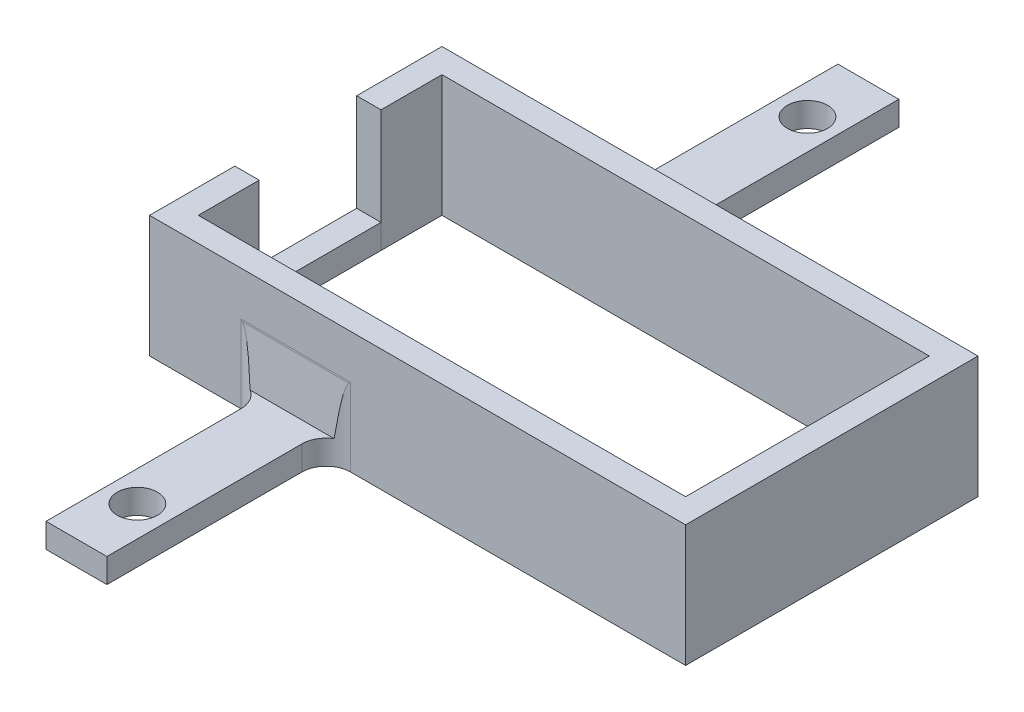
ISO-10303-21;
HEADER;
FILE_DESCRIPTION(('STEP AP214'),'2;1');
FILE_NAME('part.step','',(''),(''),'','','');
FILE_SCHEMA(('AUTOMOTIVE_DESIGN { 1 0 10303 214 1 1 1 1 }'));
ENDSEC;
DATA;
#1=APPLICATION_CONTEXT('core data for automotive mechanical design processes');
#2=APPLICATION_PROTOCOL_DEFINITION('international standard','automotive_design',2000,#1);
#3=PRODUCT_CONTEXT('',#1,'mechanical');
#4=PRODUCT('Part','Part','',(#3));
#5=PRODUCT_RELATED_PRODUCT_CATEGORY('part','',(#4));
#6=PRODUCT_DEFINITION_FORMATION('','',#4);
#7=PRODUCT_DEFINITION_CONTEXT('part definition',#1,'design');
#8=PRODUCT_DEFINITION('design','',#6,#7);
#9=PRODUCT_DEFINITION_SHAPE('','',#8);
#10=(LENGTH_UNIT() NAMED_UNIT(*) SI_UNIT(.MILLI.,.METRE.));
#11=(NAMED_UNIT(*) PLANE_ANGLE_UNIT() SI_UNIT($,.RADIAN.));
#12=(NAMED_UNIT(*) SI_UNIT($,.STERADIAN.) SOLID_ANGLE_UNIT());
#13=UNCERTAINTY_MEASURE_WITH_UNIT(LENGTH_MEASURE(1.E-05),#10,'distance_accuracy_value','');
#14=(GEOMETRIC_REPRESENTATION_CONTEXT(3) GLOBAL_UNCERTAINTY_ASSIGNED_CONTEXT((#13)) GLOBAL_UNIT_ASSIGNED_CONTEXT((#10,
#11,#12)) REPRESENTATION_CONTEXT('',''));
#15=CARTESIAN_POINT('',(0.,0.,0.));
#16=DIRECTION('',(0.,0.,1.));
#17=DIRECTION('',(1.,0.,0.));
#18=AXIS2_PLACEMENT_3D('',#15,#16,#17);
#19=CARTESIAN_POINT('',(-9.49999999999999,2.,-25.));
#20=DIRECTION('',(-1.,0.,0.));
#21=DIRECTION('',(0.,0.,1.));
#22=AXIS2_PLACEMENT_3D('',#19,#20,#21);
#23=PLANE('',#22);
#24=DIRECTION('',(0.,0.,-1.));
#25=VECTOR('',#24,1.);
#26=CARTESIAN_POINT('',(-9.49999999999999,0.,-25.));
#27=LINE('',#26,#25);
#28=CARTESIAN_POINT('',(-9.49999999999999,0.,-25.));
#29=VERTEX_POINT('',#28);
#30=CARTESIAN_POINT('',(-9.49999999999999,0.,-35.));
#31=VERTEX_POINT('',#30);
#32=EDGE_CURVE('E111',#29,#31,#27,.T.);
#33=ORIENTED_EDGE('',*,*,#32,.F.);
#34=DIRECTION('',(0.,-1.,0.));
#35=VECTOR('',#34,1.);
#36=CARTESIAN_POINT('',(-9.49999999999999,2.,-25.));
#37=LINE('',#36,#35);
#38=CARTESIAN_POINT('',(-9.49999999999999,2.,-25.));
#39=VERTEX_POINT('',#38);
#40=EDGE_CURVE('E12',#39,#29,#37,.T.);
#41=ORIENTED_EDGE('',*,*,#40,.F.);
#42=DIRECTION('',(0.,0.,-1.));
#43=VECTOR('',#42,1.);
#44=CARTESIAN_POINT('',(-9.49999999999999,2.,-25.));
#45=LINE('',#44,#43);
#46=CARTESIAN_POINT('',(-9.49999999999999,2.,-35.));
#47=VERTEX_POINT('',#46);
#48=EDGE_CURVE('E105',#39,#47,#45,.T.);
#49=ORIENTED_EDGE('',*,*,#48,.T.);
#50=DIRECTION('',(0.,-1.,0.));
#51=VECTOR('',#50,1.);
#52=CARTESIAN_POINT('',(-9.49999999999999,2.,-35.));
#53=LINE('',#52,#51);
#54=EDGE_CURVE('E50',#47,#31,#53,.T.);
#55=ORIENTED_EDGE('',*,*,#54,.T.);
#56=EDGE_LOOP('',(#33,#41,#49,#55));
#57=FACE_BOUND('',#56,.T.);
#58=ADVANCED_FACE('F47',(#57),#23,.T.);
#59=CARTESIAN_POINT('',(-9.49999999999999,2.,-25.));
#60=DIRECTION('',(0.,0.,1.));
#61=DIRECTION('',(1.,0.,0.));
#62=AXIS2_PLACEMENT_3D('',#59,#60,#61);
#63=PLANE('',#62);
#64=DIRECTION('',(-1.,0.,0.));
#65=VECTOR('',#64,1.);
#66=CARTESIAN_POINT('',(-9.49999999999999,0.,-25.));
#67=LINE('',#66,#65);
#68=CARTESIAN_POINT('',(-7.49999999999999,0.,-25.));
#69=VERTEX_POINT('',#68);
#70=EDGE_CURVE('E107',#69,#29,#67,.T.);
#71=ORIENTED_EDGE('',*,*,#70,.F.);
#72=DIRECTION('',(0.,-1.,0.));
#73=VECTOR('',#72,1.);
#74=CARTESIAN_POINT('',(-7.49999999999999,2.,-25.));
#75=LINE('',#74,#73);
#76=CARTESIAN_POINT('',(-7.49999999999999,2.,-25.));
#77=VERTEX_POINT('',#76);
#78=EDGE_CURVE('E56',#77,#69,#75,.T.);
#79=ORIENTED_EDGE('',*,*,#78,.F.);
#80=DIRECTION('',(-1.,0.,0.));
#81=VECTOR('',#80,1.);
#82=CARTESIAN_POINT('',(-9.49999999999999,2.,-25.));
#83=LINE('',#82,#81);
#84=EDGE_CURVE('E102',#77,#39,#83,.T.);
#85=ORIENTED_EDGE('',*,*,#84,.T.);
#86=ORIENTED_EDGE('',*,*,#40,.T.);
#87=EDGE_LOOP('',(#71,#79,#85,#86));
#88=FACE_BOUND('',#87,.T.);
#89=ADVANCED_FACE('F121',(#88),#63,.T.);
#90=CARTESIAN_POINT('',(-7.49999999999999,2.,-25.));
#91=DIRECTION('',(1.,0.,0.));
#92=DIRECTION('',(0.,0.,-1.));
#93=AXIS2_PLACEMENT_3D('',#90,#91,#92);
#94=PLANE('',#93);
#95=DIRECTION('',(0.,0.,1.));
#96=VECTOR('',#95,1.);
#97=CARTESIAN_POINT('',(-7.49999999999999,0.,-25.));
#98=LINE('',#97,#96);
#99=CARTESIAN_POINT('',(-7.49999999999999,0.,-35.));
#100=VERTEX_POINT('',#99);
#101=EDGE_CURVE('E97',#100,#69,#98,.T.);
#102=ORIENTED_EDGE('',*,*,#101,.F.);
#103=DIRECTION('',(0.,-1.,0.));
#104=VECTOR('',#103,1.);
#105=CARTESIAN_POINT('',(-7.49999999999999,2.,-35.));
#106=LINE('',#105,#104);
#107=CARTESIAN_POINT('',(-7.49999999999999,2.,-35.));
#108=VERTEX_POINT('',#107);
#109=EDGE_CURVE('E92',#108,#100,#106,.T.);
#110=ORIENTED_EDGE('',*,*,#109,.F.);
#111=DIRECTION('',(0.,0.,1.));
#112=VECTOR('',#111,1.);
#113=CARTESIAN_POINT('',(-7.49999999999999,2.,-25.));
#114=LINE('',#113,#112);
#115=EDGE_CURVE('E95',#108,#77,#114,.T.);
#116=ORIENTED_EDGE('',*,*,#115,.T.);
#117=ORIENTED_EDGE('',*,*,#78,.T.);
#118=EDGE_LOOP('',(#102,#110,#116,#117));
#119=FACE_BOUND('',#118,.T.);
#120=ADVANCED_FACE('F94',(#119),#94,.T.);
#121=CARTESIAN_POINT('',(-9.49999999999999,2.,-35.));
#122=DIRECTION('',(0.,0.,-1.));
#123=DIRECTION('',(-1.,0.,0.));
#124=AXIS2_PLACEMENT_3D('',#121,#122,#123);
#125=PLANE('',#124);
#126=DIRECTION('',(1.,0.,0.));
#127=VECTOR('',#126,1.);
#128=CARTESIAN_POINT('',(-9.49999999999999,0.,-35.));
#129=LINE('',#128,#127);
#130=EDGE_CURVE('E114',#31,#100,#129,.T.);
#131=ORIENTED_EDGE('',*,*,#130,.F.);
#132=ORIENTED_EDGE('',*,*,#54,.F.);
#133=DIRECTION('',(1.,0.,0.));
#134=VECTOR('',#133,1.);
#135=CARTESIAN_POINT('',(-9.49999999999999,2.,-35.));
#136=LINE('',#135,#134);
#137=EDGE_CURVE('E101',#47,#108,#136,.T.);
#138=ORIENTED_EDGE('',*,*,#137,.T.);
#139=ORIENTED_EDGE('',*,*,#109,.T.);
#140=EDGE_LOOP('',(#131,#132,#138,#139));
#141=FACE_BOUND('',#140,.T.);
#142=ADVANCED_FACE('F104',(#141),#125,.T.);
#143=CARTESIAN_POINT('',(0.,2.,0.));
#144=DIRECTION('',(0.,-1.,0.));
#145=DIRECTION('',(0.,0.,-1.));
#146=AXIS2_PLACEMENT_3D('',#143,#144,#145);
#147=PLANE('',#146);
#148=ORIENTED_EDGE('',*,*,#48,.F.);
#149=ORIENTED_EDGE('',*,*,#84,.F.);
#150=ORIENTED_EDGE('',*,*,#115,.F.);
#151=ORIENTED_EDGE('',*,*,#137,.F.);
#152=EDGE_LOOP('',(#148,#149,#150,#151));
#153=FACE_BOUND('',#152,.T.);
#154=ADVANCED_FACE('F100',(#153),#147,.F.);
#155=CARTESIAN_POINT('',(0.,0.,0.));
#156=DIRECTION('',(0.,-1.,0.));
#157=DIRECTION('',(0.,0.,-1.));
#158=AXIS2_PLACEMENT_3D('',#155,#156,#157);
#159=PLANE('',#158);
#160=ORIENTED_EDGE('',*,*,#32,.T.);
#161=ORIENTED_EDGE('',*,*,#130,.T.);
#162=ORIENTED_EDGE('',*,*,#101,.T.);
#163=ORIENTED_EDGE('',*,*,#70,.T.);
#164=EDGE_LOOP('',(#160,#161,#162,#163));
#165=FACE_BOUND('',#164,.T.);
#166=ADVANCED_FACE('F120',(#165),#159,.T.);
#167=CLOSED_SHELL('',(#58,#89,#120,#142,#154,#166));
#168=MANIFOLD_SOLID_BREP('B2',#167);
#169=CARTESIAN_POINT('',(0.,10.,-18.));
#170=DIRECTION('',(0.,0.,-1.));
#171=DIRECTION('',(-1.,0.,0.));
#172=AXIS2_PLACEMENT_3D('',#169,#170,#171);
#173=PLANE('',#172);
#174=DIRECTION('',(1.,0.,0.));
#175=VECTOR('',#174,1.);
#176=CARTESIAN_POINT('',(0.,0.,-18.));
#177=LINE('',#176,#175);
#178=CARTESIAN_POINT('',(-9.49999999999999,0.,-18.));
#179=VERTEX_POINT('',#178);
#180=CARTESIAN_POINT('',(-2.,0.,-18.));
#181=VERTEX_POINT('',#180);
#182=EDGE_CURVE('E491',#179,#181,#177,.T.);
#183=ORIENTED_EDGE('',*,*,#182,.T.);
#184=DIRECTION('',(0.,-1.,0.));
#185=VECTOR('',#184,1.);
#186=CARTESIAN_POINT('',(-2.,10.,-18.));
#187=LINE('',#186,#185);
#188=CARTESIAN_POINT('',(-2.,6.38444522981359,-18.));
#189=VERTEX_POINT('',#188);
#190=EDGE_CURVE('E428',#181,#189,#187,.F.);
#191=ORIENTED_EDGE('',*,*,#190,.T.);
#192=DIRECTION('',(1.,0.,0.));
#193=VECTOR('',#192,1.);
#194=CARTESIAN_POINT('',(0.,6.38444522981358,-18.));
#195=LINE('',#194,#193);
#196=CARTESIAN_POINT('',(7.00000000000001,6.38444522981356,-18.));
#197=VERTEX_POINT('',#196);
#198=EDGE_CURVE('E425',#189,#197,#195,.T.);
#199=ORIENTED_EDGE('',*,*,#198,.T.);
#200=DIRECTION('',(0.,-1.,0.));
#201=VECTOR('',#200,1.);
#202=CARTESIAN_POINT('',(7.00000000000001,0.,-18.));
#203=LINE('',#202,#201);
#204=CARTESIAN_POINT('',(7.00000000000001,0.,-18.));
#205=VERTEX_POINT('',#204);
#206=EDGE_CURVE('E423',#197,#205,#203,.T.);
#207=ORIENTED_EDGE('',*,*,#206,.T.);
#208=DIRECTION('',(1.,0.,0.));
#209=VECTOR('',#208,1.);
#210=CARTESIAN_POINT('',(0.,0.,-18.));
#211=LINE('',#210,#209);
#212=CARTESIAN_POINT('',(34.5,0.,-18.));
#213=VERTEX_POINT('',#212);
#214=EDGE_CURVE('E508',#205,#213,#211,.T.);
#215=ORIENTED_EDGE('',*,*,#214,.T.);
#216=DIRECTION('',(0.,-1.,0.));
#217=VECTOR('',#216,1.);
#218=CARTESIAN_POINT('',(34.5,10.,-18.));
#219=LINE('',#218,#217);
#220=CARTESIAN_POINT('',(34.5,10.,-18.));
#221=VERTEX_POINT('',#220);
#222=EDGE_CURVE('E385',#221,#213,#219,.T.);
#223=ORIENTED_EDGE('',*,*,#222,.F.);
#224=DIRECTION('',(1.,0.,0.));
#225=VECTOR('',#224,1.);
#226=CARTESIAN_POINT('',(0.,10.,-18.));
#227=LINE('',#226,#225);
#228=CARTESIAN_POINT('',(-9.49999999999999,10.,-18.));
#229=VERTEX_POINT('',#228);
#230=EDGE_CURVE('E555',#229,#221,#227,.T.);
#231=ORIENTED_EDGE('',*,*,#230,.F.);
#232=DIRECTION('',(0.,-1.,0.));
#233=VECTOR('',#232,1.);
#234=CARTESIAN_POINT('',(-9.49999999999999,10.,-18.));
#235=LINE('',#234,#233);
#236=EDGE_CURVE('E380',#229,#179,#235,.T.);
#237=ORIENTED_EDGE('',*,*,#236,.T.);
#238=EDGE_LOOP('',(#183,#191,#199,#207,#215,#223,#231,#237));
#239=FACE_BOUND('',#238,.T.);
#240=ADVANCED_FACE('F171',(#239),#173,.F.);
#241=CARTESIAN_POINT('',(0.,10.,0.));
#242=DIRECTION('',(-1.,0.,0.));
#243=DIRECTION('',(0.,0.,1.));
#244=AXIS2_PLACEMENT_3D('',#241,#242,#243);
#245=PLANE('',#244);
#246=DIRECTION('',(0.,0.,-1.));
#247=VECTOR('',#246,1.);
#248=CARTESIAN_POINT('',(0.,0.,0.));
#249=LINE('',#248,#247);
#250=CARTESIAN_POINT('',(0.,0.,-44.));
#251=VERTEX_POINT('',#250);
#252=CARTESIAN_POINT('',(0.,0.,-65.));
#253=VERTEX_POINT('',#252);
#254=EDGE_CURVE('E563',#251,#253,#249,.T.);
#255=ORIENTED_EDGE('',*,*,#254,.F.);
#256=DIRECTION('',(0.,-1.,0.));
#257=VECTOR('',#256,1.);
#258=CARTESIAN_POINT('',(0.,6.31531671911633,-44.));
#259=LINE('',#258,#257);
#260=CARTESIAN_POINT('',(0.,2.,-44.));
#261=VERTEX_POINT('',#260);
#262=EDGE_CURVE('E432',#251,#261,#259,.F.);
#263=ORIENTED_EDGE('',*,*,#262,.T.);
#264=DIRECTION('',(0.,0.,1.));
#265=VECTOR('',#264,1.);
#266=CARTESIAN_POINT('',(0.,2.,-65.));
#267=LINE('',#266,#265);
#268=CARTESIAN_POINT('',(0.,2.,-65.));
#269=VERTEX_POINT('',#268);
#270=EDGE_CURVE('E647',#269,#261,#267,.T.);
#271=ORIENTED_EDGE('',*,*,#270,.F.);
#272=DIRECTION('',(0.,-1.,0.));
#273=VECTOR('',#272,1.);
#274=CARTESIAN_POINT('',(0.,10.,-65.));
#275=LINE('',#274,#273);
#276=EDGE_CURVE('E524',#269,#253,#275,.T.);
#277=ORIENTED_EDGE('',*,*,#276,.T.);
#278=EDGE_LOOP('',(#255,#263,#271,#277));
#279=FACE_BOUND('',#278,.T.);
#280=ADVANCED_FACE('F646',(#279),#245,.T.);
#281=CARTESIAN_POINT('',(0.,10.,0.));
#282=DIRECTION('',(-1.,0.,0.));
#283=DIRECTION('',(0.,0.,1.));
#284=AXIS2_PLACEMENT_3D('',#281,#282,#283);
#285=PLANE('',#284);
#286=DIRECTION('',(0.,0.,1.));
#287=VECTOR('',#286,1.);
#288=CARTESIAN_POINT('',(0.,2.,-18.));
#289=LINE('',#288,#287);
#290=CARTESIAN_POINT('',(0.,2.,-16.));
#291=VERTEX_POINT('',#290);
#292=CARTESIAN_POINT('',(0.,2.,0.));
#293=VERTEX_POINT('',#292);
#294=EDGE_CURVE('E353',#291,#293,#289,.T.);
#295=ORIENTED_EDGE('',*,*,#294,.F.);
#296=DIRECTION('',(0.,-1.,0.));
#297=VECTOR('',#296,1.);
#298=CARTESIAN_POINT('',(0.,10.,-16.));
#299=LINE('',#298,#297);
#300=CARTESIAN_POINT('',(0.,0.,-16.));
#301=VERTEX_POINT('',#300);
#302=EDGE_CURVE('E436',#291,#301,#299,.T.);
#303=ORIENTED_EDGE('',*,*,#302,.T.);
#304=DIRECTION('',(0.,0.,-1.));
#305=VECTOR('',#304,1.);
#306=CARTESIAN_POINT('',(0.,0.,0.));
#307=LINE('',#306,#305);
#308=CARTESIAN_POINT('',(0.,0.,0.));
#309=VERTEX_POINT('',#308);
#310=EDGE_CURVE('E379',#309,#301,#307,.T.);
#311=ORIENTED_EDGE('',*,*,#310,.F.);
#312=DIRECTION('',(0.,-1.,0.));
#313=VECTOR('',#312,1.);
#314=CARTESIAN_POINT('',(0.,10.,0.));
#315=LINE('',#314,#313);
#316=EDGE_CURVE('E371',#293,#309,#315,.T.);
#317=ORIENTED_EDGE('',*,*,#316,.F.);
#318=EDGE_LOOP('',(#295,#303,#311,#317));
#319=FACE_BOUND('',#318,.T.);
#320=ADVANCED_FACE('F377',(#319),#285,.T.);
#321=CARTESIAN_POINT('',(0.,10.,0.));
#322=DIRECTION('',(0.,0.,-1.));
#323=DIRECTION('',(-1.,0.,0.));
#324=AXIS2_PLACEMENT_3D('',#321,#322,#323);
#325=PLANE('',#324);
#326=DIRECTION('',(1.,0.,0.));
#327=VECTOR('',#326,1.);
#328=CARTESIAN_POINT('',(0.,2.,0.));
#329=LINE('',#328,#327);
#330=CARTESIAN_POINT('',(5.00000000000002,2.,0.));
#331=VERTEX_POINT('',#330);
#332=EDGE_CURVE('E358',#293,#331,#329,.T.);
#333=ORIENTED_EDGE('',*,*,#332,.F.);
#334=ORIENTED_EDGE('',*,*,#316,.T.);
#335=DIRECTION('',(1.,0.,0.));
#336=VECTOR('',#335,1.);
#337=CARTESIAN_POINT('',(0.,0.,0.));
#338=LINE('',#337,#336);
#339=CARTESIAN_POINT('',(5.00000000000002,0.,0.));
#340=VERTEX_POINT('',#339);
#341=EDGE_CURVE('E498',#309,#340,#338,.T.);
#342=ORIENTED_EDGE('',*,*,#341,.T.);
#343=DIRECTION('',(0.,-1.,0.));
#344=VECTOR('',#343,1.);
#345=CARTESIAN_POINT('',(5.00000000000002,10.,0.));
#346=LINE('',#345,#344);
#347=EDGE_CURVE('E373',#331,#340,#346,.T.);
#348=ORIENTED_EDGE('',*,*,#347,.F.);
#349=EDGE_LOOP('',(#333,#334,#342,#348));
#350=FACE_BOUND('',#349,.T.);
#351=ADVANCED_FACE('F369',(#350),#325,.F.);
#352=CARTESIAN_POINT('',(5.00000000000002,10.,0.));
#353=DIRECTION('',(-1.,0.,0.));
#354=DIRECTION('',(0.,0.,1.));
#355=AXIS2_PLACEMENT_3D('',#352,#353,#354);
#356=PLANE('',#355);
#357=DIRECTION('',(0.,0.,-1.));
#358=VECTOR('',#357,1.);
#359=CARTESIAN_POINT('',(5.00000000000002,0.,0.));
#360=LINE('',#359,#358);
#361=CARTESIAN_POINT('',(5.00000000000001,0.,-16.));
#362=VERTEX_POINT('',#361);
#363=EDGE_CURVE('E505',#340,#362,#360,.T.);
#364=ORIENTED_EDGE('',*,*,#363,.T.);
#365=DIRECTION('',(0.,-1.,0.));
#366=VECTOR('',#365,1.);
#367=CARTESIAN_POINT('',(5.00000000000001,6.31531671911643,-16.));
#368=LINE('',#367,#366);
#369=CARTESIAN_POINT('',(5.00000000000001,2.,-16.));
#370=VERTEX_POINT('',#369);
#371=EDGE_CURVE('E438',#362,#370,#368,.F.);
#372=ORIENTED_EDGE('',*,*,#371,.T.);
#373=DIRECTION('',(0.,0.,-1.));
#374=VECTOR('',#373,1.);
#375=CARTESIAN_POINT('',(5.00000000000001,2.,-18.));
#376=LINE('',#375,#374);
#377=EDGE_CURVE('E374',#331,#370,#376,.T.);
#378=ORIENTED_EDGE('',*,*,#377,.F.);
#379=ORIENTED_EDGE('',*,*,#347,.T.);
#380=EDGE_LOOP('',(#364,#372,#378,#379));
#381=FACE_BOUND('',#380,.T.);
#382=ADVANCED_FACE('F688',(#381),#356,.F.);
#383=CARTESIAN_POINT('',(5.00000000000002,10.,0.));
#384=DIRECTION('',(-1.,0.,0.));
#385=DIRECTION('',(0.,0.,1.));
#386=AXIS2_PLACEMENT_3D('',#383,#384,#385);
#387=PLANE('',#386);
#388=DIRECTION('',(0.,0.,-1.));
#389=VECTOR('',#388,1.);
#390=CARTESIAN_POINT('',(5.,2.,-65.));
#391=LINE('',#390,#389);
#392=CARTESIAN_POINT('',(5.,2.,-44.));
#393=VERTEX_POINT('',#392);
#394=CARTESIAN_POINT('',(5.,2.,-65.));
#395=VERTEX_POINT('',#394);
#396=EDGE_CURVE('E653',#393,#395,#391,.T.);
#397=ORIENTED_EDGE('',*,*,#396,.F.);
#398=DIRECTION('',(0.,-1.,0.));
#399=VECTOR('',#398,1.);
#400=CARTESIAN_POINT('',(5.,10.,-44.));
#401=LINE('',#400,#399);
#402=CARTESIAN_POINT('',(5.,0.,-44.));
#403=VERTEX_POINT('',#402);
#404=EDGE_CURVE('E434',#393,#403,#401,.T.);
#405=ORIENTED_EDGE('',*,*,#404,.T.);
#406=DIRECTION('',(0.,0.,-1.));
#407=VECTOR('',#406,1.);
#408=CARTESIAN_POINT('',(5.00000000000002,0.,0.));
#409=LINE('',#408,#407);
#410=CARTESIAN_POINT('',(5.,0.,-65.));
#411=VERTEX_POINT('',#410);
#412=EDGE_CURVE('E515',#403,#411,#409,.T.);
#413=ORIENTED_EDGE('',*,*,#412,.T.);
#414=DIRECTION('',(0.,-1.,0.));
#415=VECTOR('',#414,1.);
#416=CARTESIAN_POINT('',(5.,10.,-65.));
#417=LINE('',#416,#415);
#418=EDGE_CURVE('E527',#395,#411,#417,.T.);
#419=ORIENTED_EDGE('',*,*,#418,.F.);
#420=EDGE_LOOP('',(#397,#405,#413,#419));
#421=FACE_BOUND('',#420,.T.);
#422=ADVANCED_FACE('F691',(#421),#387,.F.);
#423=CARTESIAN_POINT('',(0.,10.,-65.));
#424=DIRECTION('',(0.,0.,-1.));
#425=DIRECTION('',(-1.,0.,0.));
#426=AXIS2_PLACEMENT_3D('',#423,#424,#425);
#427=PLANE('',#426);
#428=ORIENTED_EDGE('',*,*,#276,.F.);
#429=DIRECTION('',(-1.,0.,0.));
#430=VECTOR('',#429,1.);
#431=CARTESIAN_POINT('',(0.,2.,-65.));
#432=LINE('',#431,#430);
#433=EDGE_CURVE('E365',#395,#269,#432,.T.);
#434=ORIENTED_EDGE('',*,*,#433,.F.);
#435=ORIENTED_EDGE('',*,*,#418,.T.);
#436=DIRECTION('',(1.,0.,0.));
#437=VECTOR('',#436,1.);
#438=CARTESIAN_POINT('',(0.,0.,-65.));
#439=LINE('',#438,#437);
#440=EDGE_CURVE('E517',#253,#411,#439,.T.);
#441=ORIENTED_EDGE('',*,*,#440,.F.);
#442=EDGE_LOOP('',(#428,#434,#435,#441));
#443=FACE_BOUND('',#442,.T.);
#444=ADVANCED_FACE('F715',(#443),#427,.T.);
#445=CARTESIAN_POINT('',(2.49999999999999,10.,-60.));
#446=DIRECTION('',(0.,-1.,0.));
#447=DIRECTION('',(0.,0.,-1.));
#448=AXIS2_PLACEMENT_3D('',#445,#446,#447);
#449=CYLINDRICAL_SURFACE('',#448,1.65);
#450=CARTESIAN_POINT('',(2.49999999999999,0.,-60.));
#451=DIRECTION('',(0.,1.,0.));
#452=DIRECTION('',(0.,0.,1.));
#453=AXIS2_PLACEMENT_3D('',#450,#451,#452);
#454=CIRCLE('',#453,1.65);
#455=CARTESIAN_POINT('',(2.49999999999999,0.,-58.35));
#456=VERTEX_POINT('',#455);
#457=EDGE_CURVE('E415',#456,#456,#454,.T.);
#458=ORIENTED_EDGE('',*,*,#457,.F.);
#459=EDGE_LOOP('',(#458));
#460=FACE_BOUND('',#459,.T.);
#461=CARTESIAN_POINT('',(2.49999999999999,2.,-60.));
#462=DIRECTION('',(0.,1.,0.));
#463=DIRECTION('',(0.,0.,1.));
#464=AXIS2_PLACEMENT_3D('',#461,#462,#463);
#465=CIRCLE('',#464,1.65);
#466=CARTESIAN_POINT('',(2.49999999999999,2.,-58.35));
#467=VERTEX_POINT('',#466);
#468=EDGE_CURVE('E412',#467,#467,#465,.T.);
#469=ORIENTED_EDGE('',*,*,#468,.T.);
#470=EDGE_LOOP('',(#469));
#471=FACE_BOUND('',#470,.T.);
#472=ADVANCED_FACE('F723',(#460,#471),#449,.F.);
#473=CARTESIAN_POINT('',(2.50000000000001,10.,-5.));
#474=DIRECTION('',(0.,-1.,0.));
#475=DIRECTION('',(0.,0.,-1.));
#476=AXIS2_PLACEMENT_3D('',#473,#474,#475);
#477=CYLINDRICAL_SURFACE('',#476,1.65);
#478=CARTESIAN_POINT('',(2.50000000000001,0.,-5.));
#479=DIRECTION('',(0.,1.,0.));
#480=DIRECTION('',(0.,0.,1.));
#481=AXIS2_PLACEMENT_3D('',#478,#479,#480);
#482=CIRCLE('',#481,1.65);
#483=CARTESIAN_POINT('',(2.50000000000001,0.,-3.35));
#484=VERTEX_POINT('',#483);
#485=EDGE_CURVE('E520',#484,#484,#482,.T.);
#486=ORIENTED_EDGE('',*,*,#485,.F.);
#487=EDGE_LOOP('',(#486));
#488=FACE_BOUND('',#487,.T.);
#489=CARTESIAN_POINT('',(2.50000000000001,2.,-5.));
#490=DIRECTION('',(0.,1.,0.));
#491=DIRECTION('',(0.,0.,1.));
#492=AXIS2_PLACEMENT_3D('',#489,#490,#491);
#493=CIRCLE('',#492,1.65);
#494=CARTESIAN_POINT('',(2.50000000000001,2.,-3.35));
#495=VERTEX_POINT('',#494);
#496=EDGE_CURVE('E409',#495,#495,#493,.T.);
#497=ORIENTED_EDGE('',*,*,#496,.T.);
#498=EDGE_LOOP('',(#497));
#499=FACE_BOUND('',#498,.T.);
#500=ADVANCED_FACE('F731',(#488,#499),#477,.F.);
#501=CARTESIAN_POINT('',(-9.49999999999999,10.,0.));
#502=DIRECTION('',(1.,0.,0.));
#503=DIRECTION('',(0.,0.,-1.));
#504=AXIS2_PLACEMENT_3D('',#501,#502,#503);
#505=PLANE('',#504);
#506=DIRECTION('',(0.,0.,1.));
#507=VECTOR('',#506,1.);
#508=CARTESIAN_POINT('',(-9.49999999999999,0.,0.));
#509=LINE('',#508,#507);
#510=CARTESIAN_POINT('',(-9.49999999999999,0.,-42.));
#511=VERTEX_POINT('',#510);
#512=CARTESIAN_POINT('',(-9.49999999999999,0.,-35.));
#513=VERTEX_POINT('',#512);
#514=EDGE_CURVE('E567',#511,#513,#509,.T.);
#515=ORIENTED_EDGE('',*,*,#514,.T.);
#516=DIRECTION('',(0.,-1.,0.));
#517=VECTOR('',#516,1.);
#518=CARTESIAN_POINT('',(-9.49999999999999,10.,-35.));
#519=LINE('',#518,#517);
#520=CARTESIAN_POINT('',(-9.49999999999999,10.,-35.));
#521=VERTEX_POINT('',#520);
#522=EDGE_CURVE('E403',#521,#513,#519,.T.);
#523=ORIENTED_EDGE('',*,*,#522,.F.);
#524=DIRECTION('',(0.,0.,1.));
#525=VECTOR('',#524,1.);
#526=CARTESIAN_POINT('',(-9.49999999999999,10.,0.));
#527=LINE('',#526,#525);
#528=CARTESIAN_POINT('',(-9.49999999999999,10.,-42.));
#529=VERTEX_POINT('',#528);
#530=EDGE_CURVE('E633',#529,#521,#527,.T.);
#531=ORIENTED_EDGE('',*,*,#530,.F.);
#532=DIRECTION('',(0.,-1.,0.));
#533=VECTOR('',#532,1.);
#534=CARTESIAN_POINT('',(-9.49999999999999,10.,-42.));
#535=LINE('',#534,#533);
#536=EDGE_CURVE('E406',#529,#511,#535,.T.);
#537=ORIENTED_EDGE('',*,*,#536,.T.);
#538=EDGE_LOOP('',(#515,#523,#531,#537));
#539=FACE_BOUND('',#538,.T.);
#540=ADVANCED_FACE('F632',(#539),#505,.F.);
#541=CARTESIAN_POINT('',(1.21430643318376E-13,10.,-35.));
#542=DIRECTION('',(0.,0.,-1.));
#543=DIRECTION('',(-1.,0.,0.));
#544=AXIS2_PLACEMENT_3D('',#541,#542,#543);
#545=PLANE('',#544);
#546=DIRECTION('',(1.,0.,0.));
#547=VECTOR('',#546,1.);
#548=CARTESIAN_POINT('',(1.21430643318376E-13,0.,-35.));
#549=LINE('',#548,#547);
#550=CARTESIAN_POINT('',(-7.49999999999999,0.,-35.));
#551=VERTEX_POINT('',#550);
#552=EDGE_CURVE('E570',#513,#551,#549,.T.);
#553=ORIENTED_EDGE('',*,*,#552,.T.);
#554=DIRECTION('',(0.,-1.,0.));
#555=VECTOR('',#554,1.);
#556=CARTESIAN_POINT('',(-7.49999999999999,10.,-35.));
#557=LINE('',#556,#555);
#558=CARTESIAN_POINT('',(-7.49999999999999,10.,-35.));
#559=VERTEX_POINT('',#558);
#560=EDGE_CURVE('E401',#559,#551,#557,.T.);
#561=ORIENTED_EDGE('',*,*,#560,.F.);
#562=DIRECTION('',(1.,0.,0.));
#563=VECTOR('',#562,1.);
#564=CARTESIAN_POINT('',(1.21430643318376E-13,10.,-35.));
#565=LINE('',#564,#563);
#566=EDGE_CURVE('E629',#521,#559,#565,.T.);
#567=ORIENTED_EDGE('',*,*,#566,.F.);
#568=ORIENTED_EDGE('',*,*,#522,.T.);
#569=EDGE_LOOP('',(#553,#561,#567,#568));
#570=FACE_BOUND('',#569,.T.);
#571=ADVANCED_FACE('F628',(#570),#545,.F.);
#572=CARTESIAN_POINT('',(-7.49999999999999,10.,0.));
#573=DIRECTION('',(1.,0.,0.));
#574=DIRECTION('',(0.,0.,-1.));
#575=AXIS2_PLACEMENT_3D('',#572,#573,#574);
#576=PLANE('',#575);
#577=DIRECTION('',(0.,0.,1.));
#578=VECTOR('',#577,1.);
#579=CARTESIAN_POINT('',(-7.49999999999999,0.,0.));
#580=LINE('',#579,#578);
#581=CARTESIAN_POINT('',(-7.49999999999999,0.,-40.));
#582=VERTEX_POINT('',#581);
#583=EDGE_CURVE('E573',#582,#551,#580,.T.);
#584=ORIENTED_EDGE('',*,*,#583,.F.);
#585=DIRECTION('',(0.,-1.,0.));
#586=VECTOR('',#585,1.);
#587=CARTESIAN_POINT('',(-7.49999999999999,10.,-40.));
#588=LINE('',#587,#586);
#589=CARTESIAN_POINT('',(-7.49999999999999,10.,-40.));
#590=VERTEX_POINT('',#589);
#591=EDGE_CURVE('E399',#590,#582,#588,.T.);
#592=ORIENTED_EDGE('',*,*,#591,.F.);
#593=DIRECTION('',(0.,0.,1.));
#594=VECTOR('',#593,1.);
#595=CARTESIAN_POINT('',(-7.49999999999999,10.,0.));
#596=LINE('',#595,#594);
#597=EDGE_CURVE('E622',#590,#559,#596,.T.);
#598=ORIENTED_EDGE('',*,*,#597,.T.);
#599=ORIENTED_EDGE('',*,*,#560,.T.);
#600=EDGE_LOOP('',(#584,#592,#598,#599));
#601=FACE_BOUND('',#600,.T.);
#602=ADVANCED_FACE('F621',(#601),#576,.T.);
#603=CARTESIAN_POINT('',(0.,10.,-40.));
#604=DIRECTION('',(0.,0.,-1.));
#605=DIRECTION('',(-1.,0.,0.));
#606=AXIS2_PLACEMENT_3D('',#603,#604,#605);
#607=PLANE('',#606);
#608=DIRECTION('',(1.,0.,0.));
#609=VECTOR('',#608,1.);
#610=CARTESIAN_POINT('',(0.,0.,-40.));
#611=LINE('',#610,#609);
#612=CARTESIAN_POINT('',(32.5,0.,-40.));
#613=VERTEX_POINT('',#612);
#614=EDGE_CURVE('E576',#582,#613,#611,.T.);
#615=ORIENTED_EDGE('',*,*,#614,.T.);
#616=DIRECTION('',(0.,-1.,0.));
#617=VECTOR('',#616,1.);
#618=CARTESIAN_POINT('',(32.5,10.,-40.));
#619=LINE('',#618,#617);
#620=CARTESIAN_POINT('',(32.5,10.,-40.));
#621=VERTEX_POINT('',#620);
#622=EDGE_CURVE('E396',#621,#613,#619,.T.);
#623=ORIENTED_EDGE('',*,*,#622,.F.);
#624=DIRECTION('',(1.,0.,0.));
#625=VECTOR('',#624,1.);
#626=CARTESIAN_POINT('',(0.,10.,-40.));
#627=LINE('',#626,#625);
#628=EDGE_CURVE('E617',#590,#621,#627,.T.);
#629=ORIENTED_EDGE('',*,*,#628,.F.);
#630=ORIENTED_EDGE('',*,*,#591,.T.);
#631=EDGE_LOOP('',(#615,#623,#629,#630));
#632=FACE_BOUND('',#631,.T.);
#633=ADVANCED_FACE('F616',(#632),#607,.F.);
#634=CARTESIAN_POINT('',(32.5,10.,0.));
#635=DIRECTION('',(1.,0.,0.));
#636=DIRECTION('',(0.,0.,-1.));
#637=AXIS2_PLACEMENT_3D('',#634,#635,#636);
#638=PLANE('',#637);
#639=DIRECTION('',(0.,0.,1.));
#640=VECTOR('',#639,1.);
#641=CARTESIAN_POINT('',(32.5,0.,0.));
#642=LINE('',#641,#640);
#643=CARTESIAN_POINT('',(32.5,0.,-20.));
#644=VERTEX_POINT('',#643);
#645=EDGE_CURVE('E579',#613,#644,#642,.T.);
#646=ORIENTED_EDGE('',*,*,#645,.T.);
#647=DIRECTION('',(0.,-1.,0.));
#648=VECTOR('',#647,1.);
#649=CARTESIAN_POINT('',(32.5,10.,-20.));
#650=LINE('',#649,#648);
#651=CARTESIAN_POINT('',(32.5,10.,-20.));
#652=VERTEX_POINT('',#651);
#653=EDGE_CURVE('E394',#652,#644,#650,.T.);
#654=ORIENTED_EDGE('',*,*,#653,.F.);
#655=DIRECTION('',(0.,0.,1.));
#656=VECTOR('',#655,1.);
#657=CARTESIAN_POINT('',(32.5,10.,0.));
#658=LINE('',#657,#656);
#659=EDGE_CURVE('E612',#621,#652,#658,.T.);
#660=ORIENTED_EDGE('',*,*,#659,.F.);
#661=ORIENTED_EDGE('',*,*,#622,.T.);
#662=EDGE_LOOP('',(#646,#654,#660,#661));
#663=FACE_BOUND('',#662,.T.);
#664=ADVANCED_FACE('F611',(#663),#638,.F.);
#665=CARTESIAN_POINT('',(0.,10.,-20.));
#666=DIRECTION('',(0.,0.,-1.));
#667=DIRECTION('',(-1.,0.,0.));
#668=AXIS2_PLACEMENT_3D('',#665,#666,#667);
#669=PLANE('',#668);
#670=DIRECTION('',(1.,0.,0.));
#671=VECTOR('',#670,1.);
#672=CARTESIAN_POINT('',(0.,0.,-20.));
#673=LINE('',#672,#671);
#674=CARTESIAN_POINT('',(-7.49999999999999,0.,-20.));
#675=VERTEX_POINT('',#674);
#676=EDGE_CURVE('E582',#675,#644,#673,.T.);
#677=ORIENTED_EDGE('',*,*,#676,.F.);
#678=DIRECTION('',(0.,-1.,0.));
#679=VECTOR('',#678,1.);
#680=CARTESIAN_POINT('',(-7.49999999999999,10.,-20.));
#681=LINE('',#680,#679);
#682=CARTESIAN_POINT('',(-7.49999999999999,10.,-20.));
#683=VERTEX_POINT('',#682);
#684=EDGE_CURVE('E392',#683,#675,#681,.T.);
#685=ORIENTED_EDGE('',*,*,#684,.F.);
#686=DIRECTION('',(1.,0.,0.));
#687=VECTOR('',#686,1.);
#688=CARTESIAN_POINT('',(0.,10.,-20.));
#689=LINE('',#688,#687);
#690=EDGE_CURVE('E666',#683,#652,#689,.T.);
#691=ORIENTED_EDGE('',*,*,#690,.T.);
#692=ORIENTED_EDGE('',*,*,#653,.T.);
#693=EDGE_LOOP('',(#677,#685,#691,#692));
#694=FACE_BOUND('',#693,.T.);
#695=ADVANCED_FACE('F605',(#694),#669,.T.);
#696=CARTESIAN_POINT('',(-7.49999999999999,10.,0.));
#697=DIRECTION('',(1.,0.,0.));
#698=DIRECTION('',(0.,0.,-1.));
#699=AXIS2_PLACEMENT_3D('',#696,#697,#698);
#700=PLANE('',#699);
#701=DIRECTION('',(0.,0.,1.));
#702=VECTOR('',#701,1.);
#703=CARTESIAN_POINT('',(-7.49999999999999,0.,0.));
#704=LINE('',#703,#702);
#705=CARTESIAN_POINT('',(-7.49999999999999,0.,-25.));
#706=VERTEX_POINT('',#705);
#707=EDGE_CURVE('E585',#706,#675,#704,.T.);
#708=ORIENTED_EDGE('',*,*,#707,.F.);
#709=DIRECTION('',(0.,-1.,0.));
#710=VECTOR('',#709,1.);
#711=CARTESIAN_POINT('',(-7.49999999999999,10.,-25.));
#712=LINE('',#711,#710);
#713=CARTESIAN_POINT('',(-7.49999999999999,10.,-25.));
#714=VERTEX_POINT('',#713);
#715=EDGE_CURVE('E390',#714,#706,#712,.T.);
#716=ORIENTED_EDGE('',*,*,#715,.F.);
#717=DIRECTION('',(0.,0.,1.));
#718=VECTOR('',#717,1.);
#719=CARTESIAN_POINT('',(-7.49999999999999,10.,0.));
#720=LINE('',#719,#718);
#721=EDGE_CURVE('E601',#714,#683,#720,.T.);
#722=ORIENTED_EDGE('',*,*,#721,.T.);
#723=ORIENTED_EDGE('',*,*,#684,.T.);
#724=EDGE_LOOP('',(#708,#716,#722,#723));
#725=FACE_BOUND('',#724,.T.);
#726=ADVANCED_FACE('F599',(#725),#700,.T.);
#727=CARTESIAN_POINT('',(0.,10.,-25.));
#728=DIRECTION('',(0.,0.,-1.));
#729=DIRECTION('',(-1.,0.,0.));
#730=AXIS2_PLACEMENT_3D('',#727,#728,#729);
#731=PLANE('',#730);
#732=DIRECTION('',(1.,0.,0.));
#733=VECTOR('',#732,1.);
#734=CARTESIAN_POINT('',(0.,0.,-25.));
#735=LINE('',#734,#733);
#736=CARTESIAN_POINT('',(-9.49999999999999,0.,-25.));
#737=VERTEX_POINT('',#736);
#738=EDGE_CURVE('E500',#737,#706,#735,.T.);
#739=ORIENTED_EDGE('',*,*,#738,.F.);
#740=DIRECTION('',(0.,-1.,0.));
#741=VECTOR('',#740,1.);
#742=CARTESIAN_POINT('',(-9.49999999999999,10.,-25.));
#743=LINE('',#742,#741);
#744=CARTESIAN_POINT('',(-9.49999999999999,10.,-25.));
#745=VERTEX_POINT('',#744);
#746=EDGE_CURVE('E383',#745,#737,#743,.T.);
#747=ORIENTED_EDGE('',*,*,#746,.F.);
#748=DIRECTION('',(1.,0.,0.));
#749=VECTOR('',#748,1.);
#750=CARTESIAN_POINT('',(0.,10.,-25.));
#751=LINE('',#750,#749);
#752=EDGE_CURVE('E595',#745,#714,#751,.T.);
#753=ORIENTED_EDGE('',*,*,#752,.T.);
#754=ORIENTED_EDGE('',*,*,#715,.T.);
#755=EDGE_LOOP('',(#739,#747,#753,#754));
#756=FACE_BOUND('',#755,.T.);
#757=ADVANCED_FACE('F591',(#756),#731,.T.);
#758=CARTESIAN_POINT('',(-9.49999999999999,10.,0.));
#759=DIRECTION('',(1.,0.,0.));
#760=DIRECTION('',(0.,0.,-1.));
#761=AXIS2_PLACEMENT_3D('',#758,#759,#760);
#762=PLANE('',#761);
#763=DIRECTION('',(0.,0.,1.));
#764=VECTOR('',#763,1.);
#765=CARTESIAN_POINT('',(-9.49999999999999,0.,0.));
#766=LINE('',#765,#764);
#767=EDGE_CURVE('E496',#737,#179,#766,.T.);
#768=ORIENTED_EDGE('',*,*,#767,.T.);
#769=ORIENTED_EDGE('',*,*,#236,.F.);
#770=DIRECTION('',(0.,0.,1.));
#771=VECTOR('',#770,1.);
#772=CARTESIAN_POINT('',(-9.49999999999999,10.,0.));
#773=LINE('',#772,#771);
#774=EDGE_CURVE('E557',#745,#229,#773,.T.);
#775=ORIENTED_EDGE('',*,*,#774,.F.);
#776=ORIENTED_EDGE('',*,*,#746,.T.);
#777=EDGE_LOOP('',(#768,#769,#775,#776));
#778=FACE_BOUND('',#777,.T.);
#779=ADVANCED_FACE('F670',(#778),#762,.F.);
#780=CARTESIAN_POINT('',(34.5,10.,0.));
#781=DIRECTION('',(1.,0.,0.));
#782=DIRECTION('',(0.,0.,-1.));
#783=AXIS2_PLACEMENT_3D('',#780,#781,#782);
#784=PLANE('',#783);
#785=DIRECTION('',(0.,0.,1.));
#786=VECTOR('',#785,1.);
#787=CARTESIAN_POINT('',(34.5,0.,0.));
#788=LINE('',#787,#786);
#789=CARTESIAN_POINT('',(34.5,0.,-42.));
#790=VERTEX_POINT('',#789);
#791=EDGE_CURVE('E510',#790,#213,#788,.T.);
#792=ORIENTED_EDGE('',*,*,#791,.F.);
#793=DIRECTION('',(0.,-1.,0.));
#794=VECTOR('',#793,1.);
#795=CARTESIAN_POINT('',(34.5,10.,-42.));
#796=LINE('',#795,#794);
#797=CARTESIAN_POINT('',(34.5,10.,-42.));
#798=VERTEX_POINT('',#797);
#799=EDGE_CURVE('E531',#798,#790,#796,.T.);
#800=ORIENTED_EDGE('',*,*,#799,.F.);
#801=DIRECTION('',(0.,0.,1.));
#802=VECTOR('',#801,1.);
#803=CARTESIAN_POINT('',(34.5,10.,0.));
#804=LINE('',#803,#802);
#805=EDGE_CURVE('E528',#798,#221,#804,.T.);
#806=ORIENTED_EDGE('',*,*,#805,.T.);
#807=ORIENTED_EDGE('',*,*,#222,.T.);
#808=EDGE_LOOP('',(#792,#800,#806,#807));
#809=FACE_BOUND('',#808,.T.);
#810=ADVANCED_FACE('F538',(#809),#784,.T.);
#811=CARTESIAN_POINT('',(0.,10.,-42.));
#812=DIRECTION('',(0.,0.,-1.));
#813=DIRECTION('',(-1.,0.,0.));
#814=AXIS2_PLACEMENT_3D('',#811,#812,#813);
#815=PLANE('',#814);
#816=DIRECTION('',(1.,0.,0.));
#817=VECTOR('',#816,1.);
#818=CARTESIAN_POINT('',(0.,6.38444522981339,-42.));
#819=LINE('',#818,#817);
#820=CARTESIAN_POINT('',(7.,6.38444522981342,-42.));
#821=VERTEX_POINT('',#820);
#822=CARTESIAN_POINT('',(-2.,6.38444522981339,-42.));
#823=VERTEX_POINT('',#822);
#824=EDGE_CURVE('E419',#821,#823,#819,.F.);
#825=ORIENTED_EDGE('',*,*,#824,.T.);
#826=DIRECTION('',(0.,-1.,0.));
#827=VECTOR('',#826,1.);
#828=CARTESIAN_POINT('',(-2.,0.,-42.));
#829=LINE('',#828,#827);
#830=CARTESIAN_POINT('',(-2.,0.,-42.));
#831=VERTEX_POINT('',#830);
#832=EDGE_CURVE('E421',#823,#831,#829,.T.);
#833=ORIENTED_EDGE('',*,*,#832,.T.);
#834=DIRECTION('',(1.,0.,0.));
#835=VECTOR('',#834,1.);
#836=CARTESIAN_POINT('',(0.,0.,-42.));
#837=LINE('',#836,#835);
#838=EDGE_CURVE('E565',#511,#831,#837,.T.);
#839=ORIENTED_EDGE('',*,*,#838,.F.);
#840=ORIENTED_EDGE('',*,*,#536,.F.);
#841=DIRECTION('',(1.,0.,0.));
#842=VECTOR('',#841,1.);
#843=CARTESIAN_POINT('',(0.,10.,-42.));
#844=LINE('',#843,#842);
#845=EDGE_CURVE('E523',#529,#798,#844,.T.);
#846=ORIENTED_EDGE('',*,*,#845,.T.);
#847=ORIENTED_EDGE('',*,*,#799,.T.);
#848=DIRECTION('',(1.,0.,0.));
#849=VECTOR('',#848,1.);
#850=CARTESIAN_POINT('',(0.,0.,-42.));
#851=LINE('',#850,#849);
#852=CARTESIAN_POINT('',(7.,0.,-42.));
#853=VERTEX_POINT('',#852);
#854=EDGE_CURVE('E513',#853,#790,#851,.T.);
#855=ORIENTED_EDGE('',*,*,#854,.F.);
#856=DIRECTION('',(0.,-1.,0.));
#857=VECTOR('',#856,1.);
#858=CARTESIAN_POINT('',(7.,10.,-42.));
#859=LINE('',#858,#857);
#860=EDGE_CURVE('E417',#853,#821,#859,.F.);
#861=ORIENTED_EDGE('',*,*,#860,.T.);
#862=EDGE_LOOP('',(#825,#833,#839,#840,#846,#847,#855,#861));
#863=FACE_BOUND('',#862,.T.);
#864=ADVANCED_FACE('F549',(#863),#815,.T.);
#865=CARTESIAN_POINT('',(0.,10.,0.));
#866=DIRECTION('',(0.,1.,0.));
#867=DIRECTION('',(0.,0.,1.));
#868=AXIS2_PLACEMENT_3D('',#865,#866,#867);
#869=PLANE('',#868);
#870=ORIENTED_EDGE('',*,*,#230,.T.);
#871=ORIENTED_EDGE('',*,*,#805,.F.);
#872=ORIENTED_EDGE('',*,*,#845,.F.);
#873=ORIENTED_EDGE('',*,*,#530,.T.);
#874=ORIENTED_EDGE('',*,*,#566,.T.);
#875=ORIENTED_EDGE('',*,*,#597,.F.);
#876=ORIENTED_EDGE('',*,*,#628,.T.);
#877=ORIENTED_EDGE('',*,*,#659,.T.);
#878=ORIENTED_EDGE('',*,*,#690,.F.);
#879=ORIENTED_EDGE('',*,*,#721,.F.);
#880=ORIENTED_EDGE('',*,*,#752,.F.);
#881=ORIENTED_EDGE('',*,*,#774,.T.);
#882=EDGE_LOOP('',(#870,#871,#872,#873,#874,#875,#876,#877,#878,#879,#880,#881));
#883=FACE_BOUND('',#882,.T.);
#884=ADVANCED_FACE('F552',(#883),#869,.T.);
#885=CARTESIAN_POINT('',(0.,0.,0.));
#886=DIRECTION('',(0.,1.,0.));
#887=DIRECTION('',(0.,0.,1.));
#888=AXIS2_PLACEMENT_3D('',#885,#886,#887);
#889=PLANE('',#888);
#890=ORIENTED_EDGE('',*,*,#457,.T.);
#891=EDGE_LOOP('',(#890));
#892=FACE_BOUND('',#891,.T.);
#893=ORIENTED_EDGE('',*,*,#838,.T.);
#894=CARTESIAN_POINT('',(-2.,0.,-44.));
#895=DIRECTION('',(0.,1.,0.));
#896=DIRECTION('',(0.,0.,1.));
#897=AXIS2_PLACEMENT_3D('',#894,#895,#896);
#898=CIRCLE('',#897,2.);
#899=EDGE_CURVE('E440',#831,#251,#898,.T.);
#900=ORIENTED_EDGE('',*,*,#899,.T.);
#901=ORIENTED_EDGE('',*,*,#254,.T.);
#902=ORIENTED_EDGE('',*,*,#440,.T.);
#903=ORIENTED_EDGE('',*,*,#412,.F.);
#904=CARTESIAN_POINT('',(7.,0.,-44.));
#905=DIRECTION('',(0.,1.,0.));
#906=DIRECTION('',(0.,0.,1.));
#907=AXIS2_PLACEMENT_3D('',#904,#905,#906);
#908=CIRCLE('',#907,2.);
#909=EDGE_CURVE('E448',#403,#853,#908,.T.);
#910=ORIENTED_EDGE('',*,*,#909,.T.);
#911=ORIENTED_EDGE('',*,*,#854,.T.);
#912=ORIENTED_EDGE('',*,*,#791,.T.);
#913=ORIENTED_EDGE('',*,*,#214,.F.);
#914=CARTESIAN_POINT('',(7.00000000000001,0.,-16.));
#915=DIRECTION('',(0.,1.,0.));
#916=DIRECTION('',(0.,0.,1.));
#917=AXIS2_PLACEMENT_3D('',#914,#915,#916);
#918=CIRCLE('',#917,2.);
#919=EDGE_CURVE('E460',#205,#362,#918,.T.);
#920=ORIENTED_EDGE('',*,*,#919,.T.);
#921=ORIENTED_EDGE('',*,*,#363,.F.);
#922=ORIENTED_EDGE('',*,*,#341,.F.);
#923=ORIENTED_EDGE('',*,*,#310,.T.);
#924=CARTESIAN_POINT('',(-2.,0.,-16.));
#925=DIRECTION('',(0.,1.,0.));
#926=DIRECTION('',(0.,0.,1.));
#927=AXIS2_PLACEMENT_3D('',#924,#925,#926);
#928=CIRCLE('',#927,2.);
#929=EDGE_CURVE('E455',#301,#181,#928,.T.);
#930=ORIENTED_EDGE('',*,*,#929,.T.);
#931=ORIENTED_EDGE('',*,*,#182,.F.);
#932=ORIENTED_EDGE('',*,*,#767,.F.);
#933=ORIENTED_EDGE('',*,*,#738,.T.);
#934=ORIENTED_EDGE('',*,*,#707,.T.);
#935=ORIENTED_EDGE('',*,*,#676,.T.);
#936=ORIENTED_EDGE('',*,*,#645,.F.);
#937=ORIENTED_EDGE('',*,*,#614,.F.);
#938=ORIENTED_EDGE('',*,*,#583,.T.);
#939=ORIENTED_EDGE('',*,*,#552,.F.);
#940=ORIENTED_EDGE('',*,*,#514,.F.);
#941=EDGE_LOOP('',(#893,#900,#901,#902,#903,#910,#911,#912,#913,#920,#921,#922,#923,#930,#931,
#932,#933,#934,#935,#936,#937,#938,#939,#940));
#942=FACE_BOUND('',#941,.T.);
#943=ORIENTED_EDGE('',*,*,#485,.T.);
#944=EDGE_LOOP('',(#943));
#945=FACE_BOUND('',#944,.T.);
#946=ADVANCED_FACE('F542',(#892,#942,#945),#889,.F.);
#947=CARTESIAN_POINT('',(0.,2.,0.));
#948=DIRECTION('',(0.,1.,0.));
#949=DIRECTION('',(0.,0.,1.));
#950=AXIS2_PLACEMENT_3D('',#947,#948,#949);
#951=PLANE('',#950);
#952=DIRECTION('',(1.,0.,0.));
#953=VECTOR('',#952,1.);
#954=CARTESIAN_POINT('',(0.,2.,-42.2986682332578));
#955=LINE('',#954,#953);
#956=CARTESIAN_POINT('',(-0.948586561110328,2.,-42.2986682332578));
#957=VERTEX_POINT('',#956);
#958=CARTESIAN_POINT('',(5.94858656111033,2.,-42.2986682332578));
#959=VERTEX_POINT('',#958);
#960=EDGE_CURVE('E468',#957,#959,#955,.T.);
#961=ORIENTED_EDGE('',*,*,#960,.T.);
#962=CARTESIAN_POINT('',(7.,2.,-44.));
#963=DIRECTION('',(0.,1.,0.));
#964=DIRECTION('',(0.,0.,1.));
#965=AXIS2_PLACEMENT_3D('',#962,#963,#964);
#966=CIRCLE('',#965,2.);
#967=EDGE_CURVE('E453',#959,#393,#966,.F.);
#968=ORIENTED_EDGE('',*,*,#967,.T.);
#969=ORIENTED_EDGE('',*,*,#396,.T.);
#970=ORIENTED_EDGE('',*,*,#433,.T.);
#971=ORIENTED_EDGE('',*,*,#270,.T.);
#972=CARTESIAN_POINT('',(-2.,2.,-44.));
#973=DIRECTION('',(0.,1.,0.));
#974=DIRECTION('',(0.,0.,1.));
#975=AXIS2_PLACEMENT_3D('',#972,#973,#974);
#976=CIRCLE('',#975,2.);
#977=EDGE_CURVE('E442',#261,#957,#976,.F.);
#978=ORIENTED_EDGE('',*,*,#977,.T.);
#979=EDGE_LOOP('',(#961,#968,#969,#970,#971,#978));
#980=FACE_BOUND('',#979,.T.);
#981=ORIENTED_EDGE('',*,*,#468,.F.);
#982=EDGE_LOOP('',(#981));
#983=FACE_BOUND('',#982,.T.);
#984=ADVANCED_FACE('F650',(#980,#983),#951,.T.);
#985=CARTESIAN_POINT('',(0.,2.,0.));
#986=DIRECTION('',(0.,1.,0.));
#987=DIRECTION('',(0.,0.,1.));
#988=AXIS2_PLACEMENT_3D('',#985,#986,#987);
#989=PLANE('',#988);
#990=DIRECTION('',(1.,0.,0.));
#991=VECTOR('',#990,1.);
#992=CARTESIAN_POINT('',(0.,2.,-17.7013317667423));
#993=LINE('',#992,#991);
#994=CARTESIAN_POINT('',(-0.948586561110327,2.,-17.7013317667423));
#995=VERTEX_POINT('',#994);
#996=CARTESIAN_POINT('',(5.94858656111034,2.,-17.7013317667423));
#997=VERTEX_POINT('',#996);
#998=EDGE_CURVE('E187',#995,#997,#993,.T.);
#999=ORIENTED_EDGE('',*,*,#998,.F.);
#1000=CARTESIAN_POINT('',(-2.,2.,-16.));
#1001=DIRECTION('',(0.,1.,0.));
#1002=DIRECTION('',(0.,0.,1.));
#1003=AXIS2_PLACEMENT_3D('',#1000,#1001,#1002);
#1004=CIRCLE('',#1003,2.);
#1005=EDGE_CURVE('E361',#995,#291,#1004,.F.);
#1006=ORIENTED_EDGE('',*,*,#1005,.T.);
#1007=ORIENTED_EDGE('',*,*,#294,.T.);
#1008=ORIENTED_EDGE('',*,*,#332,.T.);
#1009=ORIENTED_EDGE('',*,*,#377,.T.);
#1010=CARTESIAN_POINT('',(7.00000000000001,2.,-16.));
#1011=DIRECTION('',(0.,1.,0.));
#1012=DIRECTION('',(0.,0.,1.));
#1013=AXIS2_PLACEMENT_3D('',#1010,#1011,#1012);
#1014=CIRCLE('',#1013,2.);
#1015=EDGE_CURVE('E180',#370,#997,#1014,.F.);
#1016=ORIENTED_EDGE('',*,*,#1015,.T.);
#1017=EDGE_LOOP('',(#999,#1006,#1007,#1008,#1009,#1016));
#1018=FACE_BOUND('',#1017,.T.);
#1019=ORIENTED_EDGE('',*,*,#496,.F.);
#1020=EDGE_LOOP('',(#1019));
#1021=FACE_BOUND('',#1020,.T.);
#1022=ADVANCED_FACE('F355',(#1018,#1021),#989,.T.);
#1023=CARTESIAN_POINT('',(0.,2.,-17.7013317667423));
#1024=DIRECTION('',(0.,0.069046022260269,0.997613475655794));
#1025=DIRECTION('',(0.,-0.997613475655795,0.0690460222602691));
#1026=AXIS2_PLACEMENT_3D('',#1023,#1024,#1025);
#1027=PLANE('',#1026);
#1028=ORIENTED_EDGE('',*,*,#998,.T.);
#1029=CARTESIAN_POINT('',(7.00000000000001,-22.5817418802997,-16.));
#1030=DIRECTION('',(0.,0.069046022260269,0.997613475655794));
#1031=DIRECTION('',(0.,0.997613475655795,-0.0690460222602691));
#1032=AXIS2_PLACEMENT_3D('',#1029,#1030,#1031);
#1033=ELLIPSE('',#1032,28.9661871101133,2.);
#1034=CARTESIAN_POINT('',(6.86190795543671,6.24635318529302,-17.9952269513116));
#1035=VERTEX_POINT('',#1034);
#1036=EDGE_CURVE('E45',#997,#1035,#1033,.F.);
#1037=ORIENTED_EDGE('',*,*,#1036,.T.);
#1038=DIRECTION('',(1.,0.,0.));
#1039=VECTOR('',#1038,1.);
#1040=CARTESIAN_POINT('',(0.,6.24635318529304,-17.9952269513116));
#1041=LINE('',#1040,#1039);
#1042=CARTESIAN_POINT('',(-1.8619079554367,6.24635318529305,-17.9952269513116));
#1043=VERTEX_POINT('',#1042);
#1044=EDGE_CURVE('E430',#1035,#1043,#1041,.F.);
#1045=ORIENTED_EDGE('',*,*,#1044,.T.);
#1046=CARTESIAN_POINT('',(-2.,-22.5817418802997,-16.));
#1047=DIRECTION('',(0.,0.069046022260269,0.997613475655794));
#1048=DIRECTION('',(0.,-0.997613475655795,0.0690460222602691));
#1049=AXIS2_PLACEMENT_3D('',#1046,#1047,#1048);
#1050=ELLIPSE('',#1049,28.9661871101133,2.);
#1051=EDGE_CURVE('E457',#1043,#995,#1050,.F.);
#1052=ORIENTED_EDGE('',*,*,#1051,.T.);
#1053=EDGE_LOOP('',(#1028,#1037,#1045,#1052));
#1054=FACE_BOUND('',#1053,.T.);
#1055=ADVANCED_FACE('F481',(#1054),#1027,.T.);
#1056=CARTESIAN_POINT('',(0.,2.,-42.2986682332578));
#1057=DIRECTION('',(0.,0.0690460222602722,-0.997613475655794));
#1058=DIRECTION('',(0.,0.997613475655794,0.0690460222602722));
#1059=AXIS2_PLACEMENT_3D('',#1056,#1057,#1058);
#1060=PLANE('',#1059);
#1061=ORIENTED_EDGE('',*,*,#960,.F.);
#1062=CARTESIAN_POINT('',(-2.,-22.5817418802985,-44.));
#1063=DIRECTION('',(0.,0.0690460222602722,-0.997613475655794));
#1064=DIRECTION('',(0.,0.997613475655794,0.0690460222602722));
#1065=AXIS2_PLACEMENT_3D('',#1062,#1063,#1064);
#1066=ELLIPSE('',#1065,28.9661871101119,2.);
#1067=CARTESIAN_POINT('',(-1.8619079554367,6.24635318529284,-42.0047730486884));
#1068=VERTEX_POINT('',#1067);
#1069=EDGE_CURVE('E445',#957,#1068,#1066,.F.);
#1070=ORIENTED_EDGE('',*,*,#1069,.T.);
#1071=DIRECTION('',(1.,0.,0.));
#1072=VECTOR('',#1071,1.);
#1073=CARTESIAN_POINT('',(5.00000000000001,6.24635318529286,-42.0047730486884));
#1074=LINE('',#1073,#1072);
#1075=CARTESIAN_POINT('',(6.8619079554367,6.24635318529287,-42.0047730486884));
#1076=VERTEX_POINT('',#1075);
#1077=EDGE_CURVE('E408',#1068,#1076,#1074,.T.);
#1078=ORIENTED_EDGE('',*,*,#1077,.T.);
#1079=CARTESIAN_POINT('',(7.,-22.5817418802985,-44.));
#1080=DIRECTION('',(0.,0.0690460222602722,-0.997613475655794));
#1081=DIRECTION('',(0.,-0.997613475655794,-0.0690460222602722));
#1082=AXIS2_PLACEMENT_3D('',#1079,#1080,#1081);
#1083=ELLIPSE('',#1082,28.9661871101119,2.);
#1084=EDGE_CURVE('E450',#1076,#959,#1083,.F.);
#1085=ORIENTED_EDGE('',*,*,#1084,.T.);
#1086=EDGE_LOOP('',(#1061,#1070,#1078,#1085));
#1087=FACE_BOUND('',#1086,.T.);
#1088=ADVANCED_FACE('F833',(#1087),#1060,.T.);
#1089=CARTESIAN_POINT('',(-2.,10.,-44.));
#1090=DIRECTION('',(0.,1.,0.));
#1091=DIRECTION('',(0.,0.,1.));
#1092=AXIS2_PLACEMENT_3D('',#1089,#1090,#1091);
#1093=CYLINDRICAL_SURFACE('',#1092,2.);
#1094=ORIENTED_EDGE('',*,*,#899,.F.);
#1095=ORIENTED_EDGE('',*,*,#832,.F.);
#1096=CARTESIAN_POINT('',(-2.,6.38444522981339,-44.));
#1097=DIRECTION('',(0.707106781186546,0.707106781186549,0.));
#1098=DIRECTION('',(-0.707106781186549,0.707106781186546,0.));
#1099=AXIS2_PLACEMENT_3D('',#1096,#1097,#1098);
#1100=ELLIPSE('',#1099,2.82842712474619,2.);
#1101=EDGE_CURVE('E466',#1068,#823,#1100,.F.);
#1102=ORIENTED_EDGE('',*,*,#1101,.F.);
#1103=ORIENTED_EDGE('',*,*,#1069,.F.);
#1104=ORIENTED_EDGE('',*,*,#977,.F.);
#1105=ORIENTED_EDGE('',*,*,#262,.F.);
#1106=EDGE_LOOP('',(#1094,#1095,#1102,#1103,#1104,#1105));
#1107=FACE_BOUND('',#1106,.T.);
#1108=ADVANCED_FACE('F639',(#1107),#1093,.F.);
#1109=CARTESIAN_POINT('',(7.,10.,-44.));
#1110=DIRECTION('',(0.,-1.,0.));
#1111=DIRECTION('',(0.,0.,-1.));
#1112=AXIS2_PLACEMENT_3D('',#1109,#1110,#1111);
#1113=CYLINDRICAL_SURFACE('',#1112,2.);
#1114=ORIENTED_EDGE('',*,*,#967,.F.);
#1115=ORIENTED_EDGE('',*,*,#1084,.F.);
#1116=CARTESIAN_POINT('',(7.,6.38444522981342,-44.));
#1117=DIRECTION('',(0.707106781186549,-0.707106781186546,0.));
#1118=DIRECTION('',(-0.707106781186546,-0.707106781186549,0.));
#1119=AXIS2_PLACEMENT_3D('',#1116,#1117,#1118);
#1120=ELLIPSE('',#1119,2.82842712474619,2.);
#1121=EDGE_CURVE('E463',#821,#1076,#1120,.T.);
#1122=ORIENTED_EDGE('',*,*,#1121,.F.);
#1123=ORIENTED_EDGE('',*,*,#860,.F.);
#1124=ORIENTED_EDGE('',*,*,#909,.F.);
#1125=ORIENTED_EDGE('',*,*,#404,.F.);
#1126=EDGE_LOOP('',(#1114,#1115,#1122,#1123,#1124,#1125));
#1127=FACE_BOUND('',#1126,.T.);
#1128=ADVANCED_FACE('F847',(#1127),#1113,.F.);
#1129=CARTESIAN_POINT('',(0.,6.38444522981339,-44.));
#1130=DIRECTION('',(-1.,0.,0.));
#1131=DIRECTION('',(0.,-1.,0.));
#1132=AXIS2_PLACEMENT_3D('',#1129,#1130,#1131);
#1133=CYLINDRICAL_SURFACE('',#1132,2.);
#1134=ORIENTED_EDGE('',*,*,#1101,.T.);
#1135=ORIENTED_EDGE('',*,*,#824,.F.);
#1136=ORIENTED_EDGE('',*,*,#1121,.T.);
#1137=ORIENTED_EDGE('',*,*,#1077,.F.);
#1138=EDGE_LOOP('',(#1134,#1135,#1136,#1137));
#1139=FACE_BOUND('',#1138,.T.);
#1140=ADVANCED_FACE('F854',(#1139),#1133,.F.);
#1141=CARTESIAN_POINT('',(-2.,10.,-16.));
#1142=DIRECTION('',(0.,-1.,0.));
#1143=DIRECTION('',(0.,0.,-1.));
#1144=AXIS2_PLACEMENT_3D('',#1141,#1142,#1143);
#1145=CYLINDRICAL_SURFACE('',#1144,2.);
#1146=ORIENTED_EDGE('',*,*,#1005,.F.);
#1147=ORIENTED_EDGE('',*,*,#1051,.F.);
#1148=CARTESIAN_POINT('',(-2.,6.38444522981359,-16.));
#1149=DIRECTION('',(-0.707106781186549,-0.707106781186546,0.));
#1150=DIRECTION('',(0.707106781186546,-0.707106781186549,0.));
#1151=AXIS2_PLACEMENT_3D('',#1148,#1149,#1150);
#1152=ELLIPSE('',#1151,2.82842712474619,2.);
#1153=EDGE_CURVE('E175',#189,#1043,#1152,.T.);
#1154=ORIENTED_EDGE('',*,*,#1153,.F.);
#1155=ORIENTED_EDGE('',*,*,#190,.F.);
#1156=ORIENTED_EDGE('',*,*,#929,.F.);
#1157=ORIENTED_EDGE('',*,*,#302,.F.);
#1158=EDGE_LOOP('',(#1146,#1147,#1154,#1155,#1156,#1157));
#1159=FACE_BOUND('',#1158,.T.);
#1160=ADVANCED_FACE('F173',(#1159),#1145,.F.);
#1161=CARTESIAN_POINT('',(7.00000000000001,10.,-16.));
#1162=DIRECTION('',(0.,1.,0.));
#1163=DIRECTION('',(0.,0.,1.));
#1164=AXIS2_PLACEMENT_3D('',#1161,#1162,#1163);
#1165=CYLINDRICAL_SURFACE('',#1164,2.);
#1166=ORIENTED_EDGE('',*,*,#919,.F.);
#1167=ORIENTED_EDGE('',*,*,#206,.F.);
#1168=CARTESIAN_POINT('',(7.00000000000001,6.38444522981356,-16.));
#1169=DIRECTION('',(-0.707106781186546,0.707106781186549,0.));
#1170=DIRECTION('',(0.707106781186549,0.707106781186546,0.));
#1171=AXIS2_PLACEMENT_3D('',#1168,#1169,#1170);
#1172=ELLIPSE('',#1171,2.82842712474619,2.);
#1173=EDGE_CURVE('E469',#1035,#197,#1172,.F.);
#1174=ORIENTED_EDGE('',*,*,#1173,.F.);
#1175=ORIENTED_EDGE('',*,*,#1036,.F.);
#1176=ORIENTED_EDGE('',*,*,#1015,.F.);
#1177=ORIENTED_EDGE('',*,*,#371,.F.);
#1178=EDGE_LOOP('',(#1166,#1167,#1174,#1175,#1176,#1177));
#1179=FACE_BOUND('',#1178,.T.);
#1180=ADVANCED_FACE('F486',(#1179),#1165,.F.);
#1181=CARTESIAN_POINT('',(0.,6.38444522981358,-16.));
#1182=DIRECTION('',(1.,0.,0.));
#1183=DIRECTION('',(0.,1.,0.));
#1184=AXIS2_PLACEMENT_3D('',#1181,#1182,#1183);
#1185=CYLINDRICAL_SURFACE('',#1184,2.);
#1186=ORIENTED_EDGE('',*,*,#1153,.T.);
#1187=ORIENTED_EDGE('',*,*,#1044,.F.);
#1188=ORIENTED_EDGE('',*,*,#1173,.T.);
#1189=ORIENTED_EDGE('',*,*,#198,.F.);
#1190=EDGE_LOOP('',(#1186,#1187,#1188,#1189));
#1191=FACE_BOUND('',#1190,.T.);
#1192=ADVANCED_FACE('F476',(#1191),#1185,.F.);
#1193=CLOSED_SHELL('',(#240,#280,#320,#351,#382,#422,#444,#472,#500,#540,#571,#602,#633,#664,
#695,#726,#757,#779,#810,#864,#884,#946,#984,#1022,#1055,#1088,#1108,#1128,#1140,#1160,#1180,#1192));
#1194=MANIFOLD_SOLID_BREP('B6',#1193);
#1195=ADVANCED_BREP_SHAPE_REPRESENTATION('',(#18,#168,#1194),#14);
#1196=SHAPE_DEFINITION_REPRESENTATION(#9,#1195);
ENDSEC;
END-ISO-10303-21;
